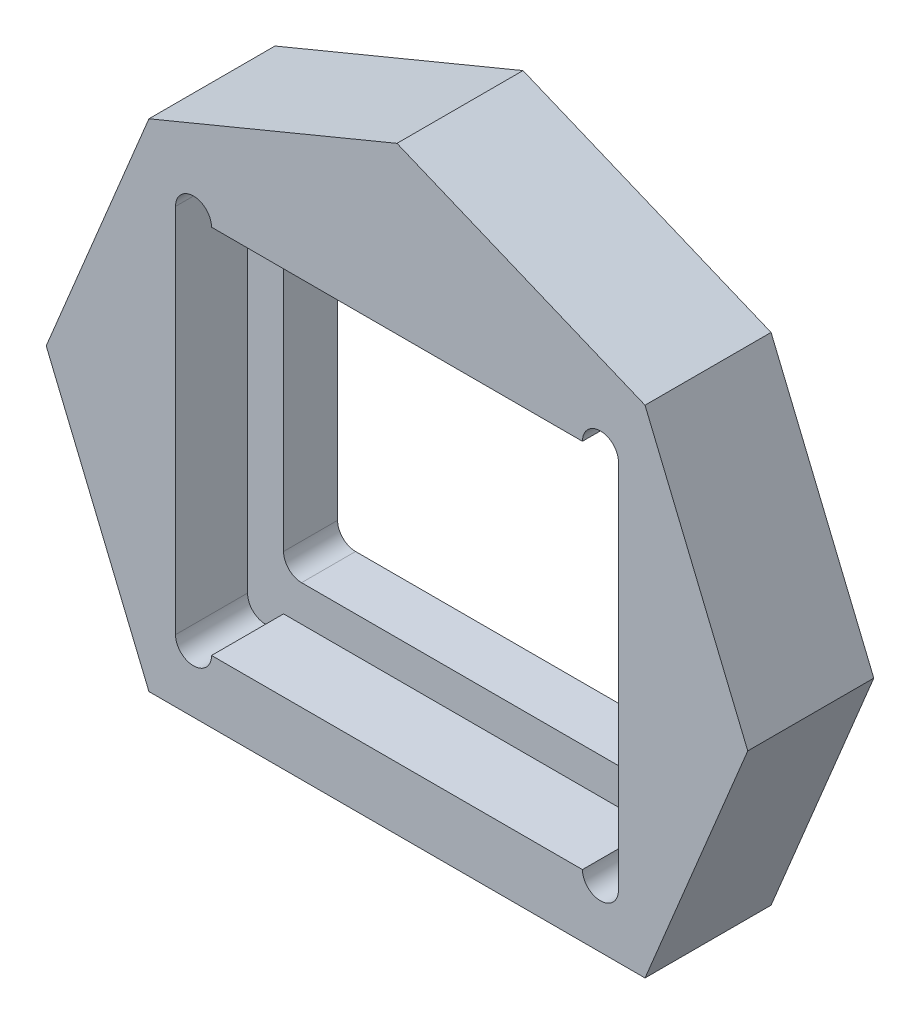
ISO-10303-21;
HEADER;
FILE_DESCRIPTION(('STEP AP214'),'2;1');
FILE_NAME('part.step','',(''),(''),'','','');
FILE_SCHEMA(('AUTOMOTIVE_DESIGN { 1 0 10303 214 1 1 1 1 }'));
ENDSEC;
DATA;
#1=APPLICATION_CONTEXT('core data for automotive mechanical design processes');
#2=APPLICATION_PROTOCOL_DEFINITION('international standard','automotive_design',2000,#1);
#3=PRODUCT_CONTEXT('',#1,'mechanical');
#4=PRODUCT('Part','Part','',(#3));
#5=PRODUCT_RELATED_PRODUCT_CATEGORY('part','',(#4));
#6=PRODUCT_DEFINITION_FORMATION('','',#4);
#7=PRODUCT_DEFINITION_CONTEXT('part definition',#1,'design');
#8=PRODUCT_DEFINITION('design','',#6,#7);
#9=PRODUCT_DEFINITION_SHAPE('','',#8);
#10=(LENGTH_UNIT() NAMED_UNIT(*) SI_UNIT(.MILLI.,.METRE.));
#11=(NAMED_UNIT(*) PLANE_ANGLE_UNIT() SI_UNIT($,.RADIAN.));
#12=(NAMED_UNIT(*) SI_UNIT($,.STERADIAN.) SOLID_ANGLE_UNIT());
#13=UNCERTAINTY_MEASURE_WITH_UNIT(LENGTH_MEASURE(1.E-05),#10,'distance_accuracy_value','');
#14=(GEOMETRIC_REPRESENTATION_CONTEXT(3) GLOBAL_UNCERTAINTY_ASSIGNED_CONTEXT((#13)) GLOBAL_UNIT_ASSIGNED_CONTEXT((#10,
#11,#12)) REPRESENTATION_CONTEXT('',''));
#15=CARTESIAN_POINT('',(0.,0.,0.));
#16=DIRECTION('',(0.,0.,1.));
#17=DIRECTION('',(1.,0.,0.));
#18=AXIS2_PLACEMENT_3D('',#15,#16,#17);
#19=CARTESIAN_POINT('',(0.,0.,1.5));
#20=DIRECTION('',(0.,0.,1.));
#21=DIRECTION('',(1.,0.,0.));
#22=AXIS2_PLACEMENT_3D('',#19,#20,#21);
#23=PLANE('',#22);
#24=CARTESIAN_POINT('',(-4.65,-3.65,1.5));
#25=DIRECTION('',(0.,0.,1.));
#26=DIRECTION('',(1.,0.,0.));
#27=AXIS2_PLACEMENT_3D('',#24,#25,#26);
#28=CIRCLE('',#27,0.5);
#29=CARTESIAN_POINT('',(-5.15,-3.65,1.5));
#30=VERTEX_POINT('',#29);
#31=CARTESIAN_POINT('',(-4.65,-4.15,1.5));
#32=VERTEX_POINT('',#31);
#33=EDGE_CURVE('E238',#30,#32,#28,.T.);
#34=ORIENTED_EDGE('',*,*,#33,.F.);
#35=DIRECTION('',(0.,-1.,0.));
#36=VECTOR('',#35,1.);
#37=CARTESIAN_POINT('',(-5.15,-3.65,1.5));
#38=LINE('',#37,#36);
#39=CARTESIAN_POINT('',(-5.15,3.65,1.5));
#40=VERTEX_POINT('',#39);
#41=EDGE_CURVE('E261',#40,#30,#38,.T.);
#42=ORIENTED_EDGE('',*,*,#41,.F.);
#43=CARTESIAN_POINT('',(-4.65,3.65,1.5));
#44=DIRECTION('',(0.,0.,1.));
#45=DIRECTION('',(-1.,0.,0.));
#46=AXIS2_PLACEMENT_3D('',#43,#44,#45);
#47=CIRCLE('',#46,0.5);
#48=CARTESIAN_POINT('',(-4.65,4.15,1.5));
#49=VERTEX_POINT('',#48);
#50=EDGE_CURVE('E257',#49,#40,#47,.T.);
#51=ORIENTED_EDGE('',*,*,#50,.F.);
#52=DIRECTION('',(-1.,0.,0.));
#53=VECTOR('',#52,1.);
#54=CARTESIAN_POINT('',(-4.65,4.15,1.5));
#55=LINE('',#54,#53);
#56=CARTESIAN_POINT('',(4.65,4.15,1.5));
#57=VERTEX_POINT('',#56);
#58=EDGE_CURVE('E254',#57,#49,#55,.T.);
#59=ORIENTED_EDGE('',*,*,#58,.F.);
#60=CARTESIAN_POINT('',(4.65,3.65,1.5));
#61=DIRECTION('',(0.,0.,1.));
#62=DIRECTION('',(-1.,0.,0.));
#63=AXIS2_PLACEMENT_3D('',#60,#61,#62);
#64=CIRCLE('',#63,0.500000000000001);
#65=CARTESIAN_POINT('',(5.15,3.65,1.5));
#66=VERTEX_POINT('',#65);
#67=EDGE_CURVE('E251',#66,#57,#64,.T.);
#68=ORIENTED_EDGE('',*,*,#67,.F.);
#69=DIRECTION('',(0.,1.,0.));
#70=VECTOR('',#69,1.);
#71=CARTESIAN_POINT('',(5.15,-3.65,1.5));
#72=LINE('',#71,#70);
#73=CARTESIAN_POINT('',(5.15,-3.65,1.5));
#74=VERTEX_POINT('',#73);
#75=EDGE_CURVE('E248',#74,#66,#72,.T.);
#76=ORIENTED_EDGE('',*,*,#75,.F.);
#77=CARTESIAN_POINT('',(4.65,-3.65,1.5));
#78=DIRECTION('',(0.,0.,1.));
#79=DIRECTION('',(-1.,0.,0.));
#80=AXIS2_PLACEMENT_3D('',#77,#78,#79);
#81=CIRCLE('',#80,0.5);
#82=CARTESIAN_POINT('',(4.65,-4.15,1.5));
#83=VERTEX_POINT('',#82);
#84=EDGE_CURVE('E245',#83,#74,#81,.T.);
#85=ORIENTED_EDGE('',*,*,#84,.F.);
#86=DIRECTION('',(1.,0.,0.));
#87=VECTOR('',#86,1.);
#88=CARTESIAN_POINT('',(-4.65,-4.15,1.5));
#89=LINE('',#88,#87);
#90=EDGE_CURVE('E241',#32,#83,#89,.T.);
#91=ORIENTED_EDGE('',*,*,#90,.F.);
#92=EDGE_LOOP('',(#34,#42,#51,#59,#68,#76,#85,#91));
#93=FACE_BOUND('',#92,.T.);
#94=DIRECTION('',(-1.,0.,0.));
#95=VECTOR('',#94,1.);
#96=CARTESIAN_POINT('',(-6.15,5.15,1.5));
#97=LINE('',#96,#95);
#98=CARTESIAN_POINT('',(5.15,5.15,1.5));
#99=VERTEX_POINT('',#98);
#100=CARTESIAN_POINT('',(-5.15,5.15,1.5));
#101=VERTEX_POINT('',#100);
#102=EDGE_CURVE('E399',#99,#101,#97,.T.);
#103=ORIENTED_EDGE('',*,*,#102,.T.);
#104=CARTESIAN_POINT('',(-5.65,5.15,1.5));
#105=DIRECTION('',(0.,0.,1.));
#106=DIRECTION('',(1.,0.,0.));
#107=AXIS2_PLACEMENT_3D('',#104,#105,#106);
#108=CIRCLE('',#107,0.5);
#109=CARTESIAN_POINT('',(-6.15,5.15,1.5));
#110=VERTEX_POINT('',#109);
#111=EDGE_CURVE('E445',#110,#101,#108,.F.);
#112=ORIENTED_EDGE('',*,*,#111,.F.);
#113=DIRECTION('',(0.,-1.,0.));
#114=VECTOR('',#113,1.);
#115=CARTESIAN_POINT('',(-6.15,-5.15,1.5));
#116=LINE('',#115,#114);
#117=CARTESIAN_POINT('',(-6.15,-5.15,1.5));
#118=VERTEX_POINT('',#117);
#119=EDGE_CURVE('E395',#110,#118,#116,.T.);
#120=ORIENTED_EDGE('',*,*,#119,.T.);
#121=CARTESIAN_POINT('',(-5.65,-5.15,1.5));
#122=DIRECTION('',(0.,0.,1.));
#123=DIRECTION('',(1.,0.,0.));
#124=AXIS2_PLACEMENT_3D('',#121,#122,#123);
#125=CIRCLE('',#124,0.5);
#126=CARTESIAN_POINT('',(-5.15,-5.15,1.5));
#127=VERTEX_POINT('',#126);
#128=EDGE_CURVE('E407',#127,#118,#125,.F.);
#129=ORIENTED_EDGE('',*,*,#128,.F.);
#130=DIRECTION('',(1.,0.,0.));
#131=VECTOR('',#130,1.);
#132=CARTESIAN_POINT('',(-6.15,-5.15,1.5));
#133=LINE('',#132,#131);
#134=CARTESIAN_POINT('',(5.15,-5.15,1.5));
#135=VERTEX_POINT('',#134);
#136=EDGE_CURVE('E390',#127,#135,#133,.T.);
#137=ORIENTED_EDGE('',*,*,#136,.T.);
#138=CARTESIAN_POINT('',(5.65,-5.15,1.5));
#139=DIRECTION('',(0.,0.,1.));
#140=DIRECTION('',(1.,0.,0.));
#141=AXIS2_PLACEMENT_3D('',#138,#139,#140);
#142=CIRCLE('',#141,0.499999999999999);
#143=CARTESIAN_POINT('',(6.15,-5.15,1.5));
#144=VERTEX_POINT('',#143);
#145=EDGE_CURVE('E433',#144,#135,#142,.F.);
#146=ORIENTED_EDGE('',*,*,#145,.F.);
#147=DIRECTION('',(0.,1.,0.));
#148=VECTOR('',#147,1.);
#149=CARTESIAN_POINT('',(6.15,-5.15,1.5));
#150=LINE('',#149,#148);
#151=CARTESIAN_POINT('',(6.15,5.15,1.5));
#152=VERTEX_POINT('',#151);
#153=EDGE_CURVE('E403',#144,#152,#150,.T.);
#154=ORIENTED_EDGE('',*,*,#153,.T.);
#155=CARTESIAN_POINT('',(5.65,5.15,1.5));
#156=DIRECTION('',(0.,0.,1.));
#157=DIRECTION('',(1.,0.,0.));
#158=AXIS2_PLACEMENT_3D('',#155,#156,#157);
#159=CIRCLE('',#158,0.5);
#160=EDGE_CURVE('E428',#99,#152,#159,.F.);
#161=ORIENTED_EDGE('',*,*,#160,.F.);
#162=EDGE_LOOP('',(#103,#112,#120,#129,#137,#146,#154,#161));
#163=FACE_BOUND('',#162,.T.);
#164=ADVANCED_FACE('F39',(#93,#163),#23,.T.);
#165=CARTESIAN_POINT('',(0.,0.,0.));
#166=DIRECTION('',(0.,0.,1.));
#167=DIRECTION('',(1.,0.,0.));
#168=AXIS2_PLACEMENT_3D('',#165,#166,#167);
#169=PLANE('',#168);
#170=DIRECTION('',(0.38268343236509,0.923879532511287,0.));
#171=VECTOR('',#170,1.);
#172=CARTESIAN_POINT('',(6.88830178257162,-6.88830178257162,0.));
#173=LINE('',#172,#171);
#174=CARTESIAN_POINT('',(6.88830178257162,-6.88830178257162,0.));
#175=VERTEX_POINT('',#174);
#176=CARTESIAN_POINT('',(9.74152980263155,0.,0.));
#177=VERTEX_POINT('',#176);
#178=EDGE_CURVE('E331',#175,#177,#173,.T.);
#179=ORIENTED_EDGE('',*,*,#178,.F.);
#180=DIRECTION('',(1.,0.,0.));
#181=VECTOR('',#180,1.);
#182=CARTESIAN_POINT('',(-6.88830178257162,-6.88830178257162,0.));
#183=LINE('',#182,#181);
#184=CARTESIAN_POINT('',(-6.88830178257162,-6.88830178257162,0.));
#185=VERTEX_POINT('',#184);
#186=EDGE_CURVE('E207',#185,#175,#183,.T.);
#187=ORIENTED_EDGE('',*,*,#186,.F.);
#188=DIRECTION('',(0.38268343236509,-0.923879532511287,0.));
#189=VECTOR('',#188,1.);
#190=CARTESIAN_POINT('',(-9.74152980263155,0.,0.));
#191=LINE('',#190,#189);
#192=CARTESIAN_POINT('',(-9.74152980263155,0.,0.));
#193=VERTEX_POINT('',#192);
#194=EDGE_CURVE('E216',#193,#185,#191,.T.);
#195=ORIENTED_EDGE('',*,*,#194,.F.);
#196=DIRECTION('',(-0.38268343236509,-0.923879532511287,0.));
#197=VECTOR('',#196,1.);
#198=CARTESIAN_POINT('',(-6.88830178257162,6.88830178257162,0.));
#199=LINE('',#198,#197);
#200=CARTESIAN_POINT('',(-6.88830178257162,6.88830178257162,0.));
#201=VERTEX_POINT('',#200);
#202=EDGE_CURVE('E326',#201,#193,#199,.T.);
#203=ORIENTED_EDGE('',*,*,#202,.F.);
#204=DIRECTION('',(-0.923879532511287,-0.382683432365089,0.));
#205=VECTOR('',#204,1.);
#206=CARTESIAN_POINT('',(0.,9.74152980263154,0.));
#207=LINE('',#206,#205);
#208=CARTESIAN_POINT('',(0.,9.74152980263154,0.));
#209=VERTEX_POINT('',#208);
#210=EDGE_CURVE('E323',#209,#201,#207,.T.);
#211=ORIENTED_EDGE('',*,*,#210,.F.);
#212=DIRECTION('',(-0.923879532511287,0.38268343236509,0.));
#213=VECTOR('',#212,1.);
#214=CARTESIAN_POINT('',(6.88830178257162,6.88830178257161,0.));
#215=LINE('',#214,#213);
#216=CARTESIAN_POINT('',(6.88830178257162,6.88830178257161,0.));
#217=VERTEX_POINT('',#216);
#218=EDGE_CURVE('E320',#217,#209,#215,.T.);
#219=ORIENTED_EDGE('',*,*,#218,.F.);
#220=DIRECTION('',(-0.38268343236509,0.923879532511287,0.));
#221=VECTOR('',#220,1.);
#222=CARTESIAN_POINT('',(9.74152980263155,0.,0.));
#223=LINE('',#222,#221);
#224=EDGE_CURVE('E316',#177,#217,#223,.T.);
#225=ORIENTED_EDGE('',*,*,#224,.F.);
#226=EDGE_LOOP('',(#179,#187,#195,#203,#211,#219,#225));
#227=FACE_BOUND('',#226,.T.);
#228=CARTESIAN_POINT('',(-4.65,-3.65,0.));
#229=DIRECTION('',(0.,0.,1.));
#230=DIRECTION('',(1.,0.,0.));
#231=AXIS2_PLACEMENT_3D('',#228,#229,#230);
#232=CIRCLE('',#231,0.5);
#233=CARTESIAN_POINT('',(-5.15,-3.65,0.));
#234=VERTEX_POINT('',#233);
#235=CARTESIAN_POINT('',(-4.65,-4.15,0.));
#236=VERTEX_POINT('',#235);
#237=EDGE_CURVE('E227',#234,#236,#232,.T.);
#238=ORIENTED_EDGE('',*,*,#237,.T.);
#239=DIRECTION('',(1.,0.,0.));
#240=VECTOR('',#239,1.);
#241=CARTESIAN_POINT('',(-4.65,-4.15,0.));
#242=LINE('',#241,#240);
#243=CARTESIAN_POINT('',(4.65,-4.15,0.));
#244=VERTEX_POINT('',#243);
#245=EDGE_CURVE('E232',#236,#244,#242,.T.);
#246=ORIENTED_EDGE('',*,*,#245,.T.);
#247=CARTESIAN_POINT('',(4.65,-3.65,0.));
#248=DIRECTION('',(0.,0.,1.));
#249=DIRECTION('',(-1.,0.,0.));
#250=AXIS2_PLACEMENT_3D('',#247,#248,#249);
#251=CIRCLE('',#250,0.5);
#252=CARTESIAN_POINT('',(5.15,-3.65,0.));
#253=VERTEX_POINT('',#252);
#254=EDGE_CURVE('E268',#244,#253,#251,.T.);
#255=ORIENTED_EDGE('',*,*,#254,.T.);
#256=DIRECTION('',(0.,1.,0.));
#257=VECTOR('',#256,1.);
#258=CARTESIAN_POINT('',(5.15,-3.65,0.));
#259=LINE('',#258,#257);
#260=CARTESIAN_POINT('',(5.15,3.65,0.));
#261=VERTEX_POINT('',#260);
#262=EDGE_CURVE('E272',#253,#261,#259,.T.);
#263=ORIENTED_EDGE('',*,*,#262,.T.);
#264=CARTESIAN_POINT('',(4.65,3.65,0.));
#265=DIRECTION('',(0.,0.,1.));
#266=DIRECTION('',(-1.,0.,0.));
#267=AXIS2_PLACEMENT_3D('',#264,#265,#266);
#268=CIRCLE('',#267,0.500000000000001);
#269=CARTESIAN_POINT('',(4.65,4.15,0.));
#270=VERTEX_POINT('',#269);
#271=EDGE_CURVE('E276',#261,#270,#268,.T.);
#272=ORIENTED_EDGE('',*,*,#271,.T.);
#273=DIRECTION('',(-1.,0.,0.));
#274=VECTOR('',#273,1.);
#275=CARTESIAN_POINT('',(-4.65,4.15,0.));
#276=LINE('',#275,#274);
#277=CARTESIAN_POINT('',(-4.65,4.15,0.));
#278=VERTEX_POINT('',#277);
#279=EDGE_CURVE('E280',#270,#278,#276,.T.);
#280=ORIENTED_EDGE('',*,*,#279,.T.);
#281=CARTESIAN_POINT('',(-4.65,3.65,0.));
#282=DIRECTION('',(0.,0.,1.));
#283=DIRECTION('',(-1.,0.,0.));
#284=AXIS2_PLACEMENT_3D('',#281,#282,#283);
#285=CIRCLE('',#284,0.5);
#286=CARTESIAN_POINT('',(-5.15,3.65,0.));
#287=VERTEX_POINT('',#286);
#288=EDGE_CURVE('E284',#278,#287,#285,.T.);
#289=ORIENTED_EDGE('',*,*,#288,.T.);
#290=DIRECTION('',(0.,-1.,0.));
#291=VECTOR('',#290,1.);
#292=CARTESIAN_POINT('',(-5.15,-3.65,0.));
#293=LINE('',#292,#291);
#294=EDGE_CURVE('E242',#287,#234,#293,.T.);
#295=ORIENTED_EDGE('',*,*,#294,.T.);
#296=EDGE_LOOP('',(#238,#246,#255,#263,#272,#280,#289,#295));
#297=FACE_BOUND('',#296,.T.);
#298=ADVANCED_FACE('F357',(#227,#297),#169,.F.);
#299=CARTESIAN_POINT('',(9.74152980263155,0.,1.5));
#300=DIRECTION('',(-0.923879532511287,-0.38268343236509,0.));
#301=DIRECTION('',(0.38268343236509,-0.923879532511287,0.));
#302=AXIS2_PLACEMENT_3D('',#299,#300,#301);
#303=PLANE('',#302);
#304=ORIENTED_EDGE('',*,*,#224,.T.);
#305=DIRECTION('',(0.,0.,-1.));
#306=VECTOR('',#305,1.);
#307=CARTESIAN_POINT('',(6.88830178257162,6.88830178257161,1.5));
#308=LINE('',#307,#306);
#309=CARTESIAN_POINT('',(6.88830178257162,6.88830178257161,3.5));
#310=VERTEX_POINT('',#309);
#311=EDGE_CURVE('E11',#310,#217,#308,.T.);
#312=ORIENTED_EDGE('',*,*,#311,.F.);
#313=DIRECTION('',(-0.38268343236509,0.923879532511287,0.));
#314=VECTOR('',#313,1.);
#315=CARTESIAN_POINT('',(9.74152980263155,0.,3.5));
#316=LINE('',#315,#314);
#317=CARTESIAN_POINT('',(9.74152980263155,0.,3.5));
#318=VERTEX_POINT('',#317);
#319=EDGE_CURVE('E366',#318,#310,#316,.T.);
#320=ORIENTED_EDGE('',*,*,#319,.F.);
#321=DIRECTION('',(0.,0.,-1.));
#322=VECTOR('',#321,1.);
#323=CARTESIAN_POINT('',(9.74152980263155,0.,1.5));
#324=LINE('',#323,#322);
#325=EDGE_CURVE('E334',#318,#177,#324,.T.);
#326=ORIENTED_EDGE('',*,*,#325,.T.);
#327=EDGE_LOOP('',(#304,#312,#320,#326));
#328=FACE_BOUND('',#327,.T.);
#329=ADVANCED_FACE('F41',(#328),#303,.F.);
#330=CARTESIAN_POINT('',(6.88830178257162,6.88830178257161,1.5));
#331=DIRECTION('',(-0.38268343236509,-0.923879532511287,0.));
#332=DIRECTION('',(0.923879532511287,-0.38268343236509,0.));
#333=AXIS2_PLACEMENT_3D('',#330,#331,#332);
#334=PLANE('',#333);
#335=ORIENTED_EDGE('',*,*,#218,.T.);
#336=DIRECTION('',(0.,0.,-1.));
#337=VECTOR('',#336,1.);
#338=CARTESIAN_POINT('',(0.,9.74152980263154,1.5));
#339=LINE('',#338,#337);
#340=CARTESIAN_POINT('',(0.,9.74152980263154,3.5));
#341=VERTEX_POINT('',#340);
#342=EDGE_CURVE('E48',#341,#209,#339,.T.);
#343=ORIENTED_EDGE('',*,*,#342,.F.);
#344=DIRECTION('',(-0.923879532511287,0.38268343236509,0.));
#345=VECTOR('',#344,1.);
#346=CARTESIAN_POINT('',(6.88830178257162,6.88830178257161,3.5));
#347=LINE('',#346,#345);
#348=EDGE_CURVE('E363',#310,#341,#347,.T.);
#349=ORIENTED_EDGE('',*,*,#348,.F.);
#350=ORIENTED_EDGE('',*,*,#311,.T.);
#351=EDGE_LOOP('',(#335,#343,#349,#350));
#352=FACE_BOUND('',#351,.T.);
#353=ADVANCED_FACE('F459',(#352),#334,.F.);
#354=CARTESIAN_POINT('',(0.,9.74152980263154,1.5));
#355=DIRECTION('',(0.382683432365089,-0.923879532511287,0.));
#356=DIRECTION('',(0.923879532511287,0.38268343236509,0.));
#357=AXIS2_PLACEMENT_3D('',#354,#355,#356);
#358=PLANE('',#357);
#359=ORIENTED_EDGE('',*,*,#210,.T.);
#360=DIRECTION('',(0.,0.,-1.));
#361=VECTOR('',#360,1.);
#362=CARTESIAN_POINT('',(-6.88830178257162,6.88830178257162,1.5));
#363=LINE('',#362,#361);
#364=CARTESIAN_POINT('',(-6.88830178257162,6.88830178257162,3.5));
#365=VERTEX_POINT('',#364);
#366=EDGE_CURVE('E342',#365,#201,#363,.T.);
#367=ORIENTED_EDGE('',*,*,#366,.F.);
#368=DIRECTION('',(-0.923879532511287,-0.382683432365089,0.));
#369=VECTOR('',#368,1.);
#370=CARTESIAN_POINT('',(0.,9.74152980263154,3.5));
#371=LINE('',#370,#369);
#372=EDGE_CURVE('E234',#341,#365,#371,.T.);
#373=ORIENTED_EDGE('',*,*,#372,.F.);
#374=ORIENTED_EDGE('',*,*,#342,.T.);
#375=EDGE_LOOP('',(#359,#367,#373,#374));
#376=FACE_BOUND('',#375,.T.);
#377=ADVANCED_FACE('F350',(#376),#358,.F.);
#378=CARTESIAN_POINT('',(-6.88830178257162,6.88830178257162,1.5));
#379=DIRECTION('',(0.923879532511287,-0.38268343236509,0.));
#380=DIRECTION('',(0.38268343236509,0.923879532511287,0.));
#381=AXIS2_PLACEMENT_3D('',#378,#379,#380);
#382=PLANE('',#381);
#383=ORIENTED_EDGE('',*,*,#202,.T.);
#384=DIRECTION('',(0.,0.,-1.));
#385=VECTOR('',#384,1.);
#386=CARTESIAN_POINT('',(-9.74152980263155,0.,1.5));
#387=LINE('',#386,#385);
#388=CARTESIAN_POINT('',(-9.74152980263155,0.,3.5));
#389=VERTEX_POINT('',#388);
#390=EDGE_CURVE('E218',#389,#193,#387,.T.);
#391=ORIENTED_EDGE('',*,*,#390,.F.);
#392=DIRECTION('',(-0.38268343236509,-0.923879532511287,0.));
#393=VECTOR('',#392,1.);
#394=CARTESIAN_POINT('',(-6.88830178257162,6.88830178257162,3.5));
#395=LINE('',#394,#393);
#396=EDGE_CURVE('E225',#365,#389,#395,.T.);
#397=ORIENTED_EDGE('',*,*,#396,.F.);
#398=ORIENTED_EDGE('',*,*,#366,.T.);
#399=EDGE_LOOP('',(#383,#391,#397,#398));
#400=FACE_BOUND('',#399,.T.);
#401=ADVANCED_FACE('F361',(#400),#382,.F.);
#402=CARTESIAN_POINT('',(-9.74152980263155,0.,1.5));
#403=DIRECTION('',(0.923879532511287,0.38268343236509,0.));
#404=DIRECTION('',(-0.38268343236509,0.923879532511287,0.));
#405=AXIS2_PLACEMENT_3D('',#402,#403,#404);
#406=PLANE('',#405);
#407=ORIENTED_EDGE('',*,*,#194,.T.);
#408=DIRECTION('',(0.,0.,-1.));
#409=VECTOR('',#408,1.);
#410=CARTESIAN_POINT('',(-6.88830178257162,-6.88830178257162,1.5));
#411=LINE('',#410,#409);
#412=CARTESIAN_POINT('',(-6.88830178257162,-6.88830178257162,3.5));
#413=VERTEX_POINT('',#412);
#414=EDGE_CURVE('E197',#413,#185,#411,.T.);
#415=ORIENTED_EDGE('',*,*,#414,.F.);
#416=DIRECTION('',(0.38268343236509,-0.923879532511287,0.));
#417=VECTOR('',#416,1.);
#418=CARTESIAN_POINT('',(-9.74152980263155,0.,3.5));
#419=LINE('',#418,#417);
#420=EDGE_CURVE('E214',#389,#413,#419,.T.);
#421=ORIENTED_EDGE('',*,*,#420,.F.);
#422=ORIENTED_EDGE('',*,*,#390,.T.);
#423=EDGE_LOOP('',(#407,#415,#421,#422));
#424=FACE_BOUND('',#423,.T.);
#425=ADVANCED_FACE('F212',(#424),#406,.F.);
#426=CARTESIAN_POINT('',(6.88830178257162,-6.88830178257162,1.5));
#427=DIRECTION('',(-0.923879532511287,0.38268343236509,0.));
#428=DIRECTION('',(-0.38268343236509,-0.923879532511287,0.));
#429=AXIS2_PLACEMENT_3D('',#426,#427,#428);
#430=PLANE('',#429);
#431=ORIENTED_EDGE('',*,*,#178,.T.);
#432=ORIENTED_EDGE('',*,*,#325,.F.);
#433=DIRECTION('',(0.38268343236509,0.923879532511287,0.));
#434=VECTOR('',#433,1.);
#435=CARTESIAN_POINT('',(6.88830178257162,-6.88830178257162,3.5));
#436=LINE('',#435,#434);
#437=CARTESIAN_POINT('',(6.88830178257162,-6.88830178257162,3.5));
#438=VERTEX_POINT('',#437);
#439=EDGE_CURVE('E371',#438,#318,#436,.T.);
#440=ORIENTED_EDGE('',*,*,#439,.F.);
#441=DIRECTION('',(0.,0.,-1.));
#442=VECTOR('',#441,1.);
#443=CARTESIAN_POINT('',(6.88830178257162,-6.88830178257162,1.5));
#444=LINE('',#443,#442);
#445=EDGE_CURVE('E200',#438,#175,#444,.T.);
#446=ORIENTED_EDGE('',*,*,#445,.T.);
#447=EDGE_LOOP('',(#431,#432,#440,#446));
#448=FACE_BOUND('',#447,.T.);
#449=ADVANCED_FACE('F456',(#448),#430,.F.);
#450=CARTESIAN_POINT('',(-4.65,-3.65,1.5));
#451=DIRECTION('',(0.,0.,-1.));
#452=DIRECTION('',(-1.,0.,0.));
#453=AXIS2_PLACEMENT_3D('',#450,#451,#452);
#454=CYLINDRICAL_SURFACE('',#453,0.5);
#455=ORIENTED_EDGE('',*,*,#237,.F.);
#456=DIRECTION('',(0.,0.,-1.));
#457=VECTOR('',#456,1.);
#458=CARTESIAN_POINT('',(-5.15,-3.65,1.5));
#459=LINE('',#458,#457);
#460=EDGE_CURVE('E263',#30,#234,#459,.T.);
#461=ORIENTED_EDGE('',*,*,#460,.F.);
#462=ORIENTED_EDGE('',*,*,#33,.T.);
#463=DIRECTION('',(0.,0.,-1.));
#464=VECTOR('',#463,1.);
#465=CARTESIAN_POINT('',(-4.65,-4.15,1.5));
#466=LINE('',#465,#464);
#467=EDGE_CURVE('E312',#32,#236,#466,.T.);
#468=ORIENTED_EDGE('',*,*,#467,.T.);
#469=EDGE_LOOP('',(#455,#461,#462,#468));
#470=FACE_BOUND('',#469,.T.);
#471=ADVANCED_FACE('F477',(#470),#454,.F.);
#472=CARTESIAN_POINT('',(-4.65,-4.15,1.5));
#473=DIRECTION('',(0.,1.,0.));
#474=DIRECTION('',(0.,0.,1.));
#475=AXIS2_PLACEMENT_3D('',#472,#473,#474);
#476=PLANE('',#475);
#477=ORIENTED_EDGE('',*,*,#245,.F.);
#478=ORIENTED_EDGE('',*,*,#467,.F.);
#479=ORIENTED_EDGE('',*,*,#90,.T.);
#480=DIRECTION('',(0.,0.,-1.));
#481=VECTOR('',#480,1.);
#482=CARTESIAN_POINT('',(4.65,-4.15,1.5));
#483=LINE('',#482,#481);
#484=EDGE_CURVE('E309',#83,#244,#483,.T.);
#485=ORIENTED_EDGE('',*,*,#484,.T.);
#486=EDGE_LOOP('',(#477,#478,#479,#485));
#487=FACE_BOUND('',#486,.T.);
#488=ADVANCED_FACE('F511',(#487),#476,.T.);
#489=CARTESIAN_POINT('',(4.65,-3.65,1.5));
#490=DIRECTION('',(0.,0.,-1.));
#491=DIRECTION('',(-1.,0.,0.));
#492=AXIS2_PLACEMENT_3D('',#489,#490,#491);
#493=CYLINDRICAL_SURFACE('',#492,0.5);
#494=ORIENTED_EDGE('',*,*,#254,.F.);
#495=ORIENTED_EDGE('',*,*,#484,.F.);
#496=ORIENTED_EDGE('',*,*,#84,.T.);
#497=DIRECTION('',(0.,0.,-1.));
#498=VECTOR('',#497,1.);
#499=CARTESIAN_POINT('',(5.15,-3.65,1.5));
#500=LINE('',#499,#498);
#501=EDGE_CURVE('E306',#74,#253,#500,.T.);
#502=ORIENTED_EDGE('',*,*,#501,.T.);
#503=EDGE_LOOP('',(#494,#495,#496,#502));
#504=FACE_BOUND('',#503,.T.);
#505=ADVANCED_FACE('F518',(#504),#493,.F.);
#506=CARTESIAN_POINT('',(5.15,-3.65,1.5));
#507=DIRECTION('',(-1.,0.,0.));
#508=DIRECTION('',(0.,-1.,0.));
#509=AXIS2_PLACEMENT_3D('',#506,#507,#508);
#510=PLANE('',#509);
#511=ORIENTED_EDGE('',*,*,#262,.F.);
#512=ORIENTED_EDGE('',*,*,#501,.F.);
#513=ORIENTED_EDGE('',*,*,#75,.T.);
#514=DIRECTION('',(0.,0.,-1.));
#515=VECTOR('',#514,1.);
#516=CARTESIAN_POINT('',(5.15,3.65,1.5));
#517=LINE('',#516,#515);
#518=EDGE_CURVE('E303',#66,#261,#517,.T.);
#519=ORIENTED_EDGE('',*,*,#518,.T.);
#520=EDGE_LOOP('',(#511,#512,#513,#519));
#521=FACE_BOUND('',#520,.T.);
#522=ADVANCED_FACE('F525',(#521),#510,.T.);
#523=CARTESIAN_POINT('',(4.65,3.65,1.5));
#524=DIRECTION('',(0.,0.,-1.));
#525=DIRECTION('',(-1.,0.,0.));
#526=AXIS2_PLACEMENT_3D('',#523,#524,#525);
#527=CYLINDRICAL_SURFACE('',#526,0.500000000000001);
#528=ORIENTED_EDGE('',*,*,#271,.F.);
#529=ORIENTED_EDGE('',*,*,#518,.F.);
#530=ORIENTED_EDGE('',*,*,#67,.T.);
#531=DIRECTION('',(0.,0.,-1.));
#532=VECTOR('',#531,1.);
#533=CARTESIAN_POINT('',(4.65,4.15,1.5));
#534=LINE('',#533,#532);
#535=EDGE_CURVE('E300',#57,#270,#534,.T.);
#536=ORIENTED_EDGE('',*,*,#535,.T.);
#537=EDGE_LOOP('',(#528,#529,#530,#536));
#538=FACE_BOUND('',#537,.T.);
#539=ADVANCED_FACE('F533',(#538),#527,.F.);
#540=CARTESIAN_POINT('',(-4.65,4.15,1.5));
#541=DIRECTION('',(0.,-1.,0.));
#542=DIRECTION('',(0.,0.,-1.));
#543=AXIS2_PLACEMENT_3D('',#540,#541,#542);
#544=PLANE('',#543);
#545=ORIENTED_EDGE('',*,*,#279,.F.);
#546=ORIENTED_EDGE('',*,*,#535,.F.);
#547=ORIENTED_EDGE('',*,*,#58,.T.);
#548=DIRECTION('',(0.,0.,-1.));
#549=VECTOR('',#548,1.);
#550=CARTESIAN_POINT('',(-4.65,4.15,1.5));
#551=LINE('',#550,#549);
#552=EDGE_CURVE('E297',#49,#278,#551,.T.);
#553=ORIENTED_EDGE('',*,*,#552,.T.);
#554=EDGE_LOOP('',(#545,#546,#547,#553));
#555=FACE_BOUND('',#554,.T.);
#556=ADVANCED_FACE('F541',(#555),#544,.T.);
#557=CARTESIAN_POINT('',(-4.65,3.65,1.5));
#558=DIRECTION('',(0.,0.,-1.));
#559=DIRECTION('',(-1.,0.,0.));
#560=AXIS2_PLACEMENT_3D('',#557,#558,#559);
#561=CYLINDRICAL_SURFACE('',#560,0.5);
#562=ORIENTED_EDGE('',*,*,#288,.F.);
#563=ORIENTED_EDGE('',*,*,#552,.F.);
#564=ORIENTED_EDGE('',*,*,#50,.T.);
#565=DIRECTION('',(0.,0.,-1.));
#566=VECTOR('',#565,1.);
#567=CARTESIAN_POINT('',(-5.15,3.65,1.5));
#568=LINE('',#567,#566);
#569=EDGE_CURVE('E294',#40,#287,#568,.T.);
#570=ORIENTED_EDGE('',*,*,#569,.T.);
#571=EDGE_LOOP('',(#562,#563,#564,#570));
#572=FACE_BOUND('',#571,.T.);
#573=ADVANCED_FACE('F549',(#572),#561,.F.);
#574=CARTESIAN_POINT('',(-5.15,-3.65,1.5));
#575=DIRECTION('',(1.,0.,0.));
#576=DIRECTION('',(0.,0.,-1.));
#577=AXIS2_PLACEMENT_3D('',#574,#575,#576);
#578=PLANE('',#577);
#579=ORIENTED_EDGE('',*,*,#294,.F.);
#580=ORIENTED_EDGE('',*,*,#569,.F.);
#581=ORIENTED_EDGE('',*,*,#41,.T.);
#582=ORIENTED_EDGE('',*,*,#460,.T.);
#583=EDGE_LOOP('',(#579,#580,#581,#582));
#584=FACE_BOUND('',#583,.T.);
#585=ADVANCED_FACE('F557',(#584),#578,.T.);
#586=CARTESIAN_POINT('',(0.,0.,3.5));
#587=DIRECTION('',(0.,0.,1.));
#588=DIRECTION('',(1.,0.,0.));
#589=AXIS2_PLACEMENT_3D('',#586,#587,#588);
#590=PLANE('',#589);
#591=DIRECTION('',(-1.,0.,0.));
#592=VECTOR('',#591,1.);
#593=CARTESIAN_POINT('',(-6.88830178257162,-6.88830178257162,3.5));
#594=LINE('',#593,#592);
#595=EDGE_CURVE('E194',#438,#413,#594,.T.);
#596=ORIENTED_EDGE('',*,*,#595,.F.);
#597=ORIENTED_EDGE('',*,*,#439,.T.);
#598=ORIENTED_EDGE('',*,*,#319,.T.);
#599=ORIENTED_EDGE('',*,*,#348,.T.);
#600=ORIENTED_EDGE('',*,*,#372,.T.);
#601=ORIENTED_EDGE('',*,*,#396,.T.);
#602=ORIENTED_EDGE('',*,*,#420,.T.);
#603=EDGE_LOOP('',(#596,#597,#598,#599,#600,#601,#602));
#604=FACE_BOUND('',#603,.T.);
#605=CARTESIAN_POINT('',(-5.65,-5.15,3.5));
#606=DIRECTION('',(0.,0.,1.));
#607=DIRECTION('',(1.,0.,0.));
#608=AXIS2_PLACEMENT_3D('',#605,#606,#607);
#609=CIRCLE('',#608,0.5);
#610=CARTESIAN_POINT('',(-6.15,-5.15,3.5));
#611=VERTEX_POINT('',#610);
#612=CARTESIAN_POINT('',(-5.15,-5.15,3.5));
#613=VERTEX_POINT('',#612);
#614=EDGE_CURVE('E436',#611,#613,#609,.T.);
#615=ORIENTED_EDGE('',*,*,#614,.F.);
#616=DIRECTION('',(0.,-1.,0.));
#617=VECTOR('',#616,1.);
#618=CARTESIAN_POINT('',(-6.15,-5.15,3.5));
#619=LINE('',#618,#617);
#620=CARTESIAN_POINT('',(-6.15,5.15,3.5));
#621=VERTEX_POINT('',#620);
#622=EDGE_CURVE('E411',#621,#611,#619,.T.);
#623=ORIENTED_EDGE('',*,*,#622,.F.);
#624=CARTESIAN_POINT('',(-5.65,5.15,3.5));
#625=DIRECTION('',(0.,0.,1.));
#626=DIRECTION('',(1.,0.,0.));
#627=AXIS2_PLACEMENT_3D('',#624,#625,#626);
#628=CIRCLE('',#627,0.5);
#629=CARTESIAN_POINT('',(-5.15,5.15,3.5));
#630=VERTEX_POINT('',#629);
#631=EDGE_CURVE('E442',#630,#621,#628,.T.);
#632=ORIENTED_EDGE('',*,*,#631,.F.);
#633=DIRECTION('',(-1.,0.,0.));
#634=VECTOR('',#633,1.);
#635=CARTESIAN_POINT('',(-6.15,5.15,3.5));
#636=LINE('',#635,#634);
#637=CARTESIAN_POINT('',(5.15,5.15,3.5));
#638=VERTEX_POINT('',#637);
#639=EDGE_CURVE('E415',#638,#630,#636,.T.);
#640=ORIENTED_EDGE('',*,*,#639,.F.);
#641=CARTESIAN_POINT('',(5.65,5.15,3.5));
#642=DIRECTION('',(0.,0.,1.));
#643=DIRECTION('',(1.,0.,0.));
#644=AXIS2_PLACEMENT_3D('',#641,#642,#643);
#645=CIRCLE('',#644,0.5);
#646=CARTESIAN_POINT('',(6.15,5.15,3.5));
#647=VERTEX_POINT('',#646);
#648=EDGE_CURVE('E425',#647,#638,#645,.T.);
#649=ORIENTED_EDGE('',*,*,#648,.F.);
#650=DIRECTION('',(0.,1.,0.));
#651=VECTOR('',#650,1.);
#652=CARTESIAN_POINT('',(6.15,-5.15,3.5));
#653=LINE('',#652,#651);
#654=CARTESIAN_POINT('',(6.15,-5.15,3.5));
#655=VERTEX_POINT('',#654);
#656=EDGE_CURVE('E394',#655,#647,#653,.T.);
#657=ORIENTED_EDGE('',*,*,#656,.F.);
#658=CARTESIAN_POINT('',(5.65,-5.15,3.5));
#659=DIRECTION('',(0.,0.,1.));
#660=DIRECTION('',(1.,0.,0.));
#661=AXIS2_PLACEMENT_3D('',#658,#659,#660);
#662=CIRCLE('',#661,0.499999999999999);
#663=CARTESIAN_POINT('',(5.15,-5.15,3.5));
#664=VERTEX_POINT('',#663);
#665=EDGE_CURVE('E206',#664,#655,#662,.T.);
#666=ORIENTED_EDGE('',*,*,#665,.F.);
#667=DIRECTION('',(1.,0.,0.));
#668=VECTOR('',#667,1.);
#669=CARTESIAN_POINT('',(-6.15,-5.15,3.5));
#670=LINE('',#669,#668);
#671=EDGE_CURVE('E389',#613,#664,#670,.T.);
#672=ORIENTED_EDGE('',*,*,#671,.F.);
#673=EDGE_LOOP('',(#615,#623,#632,#640,#649,#657,#666,#672));
#674=FACE_BOUND('',#673,.T.);
#675=ADVANCED_FACE('F221',(#604,#674),#590,.T.);
#676=CARTESIAN_POINT('',(6.15,-5.15,3.5));
#677=DIRECTION('',(-1.,0.,0.));
#678=DIRECTION('',(0.,0.,1.));
#679=AXIS2_PLACEMENT_3D('',#676,#677,#678);
#680=PLANE('',#679);
#681=ORIENTED_EDGE('',*,*,#153,.F.);
#682=DIRECTION('',(0.,0.,-1.));
#683=VECTOR('',#682,1.);
#684=CARTESIAN_POINT('',(6.15,-5.15,3.5));
#685=LINE('',#684,#683);
#686=EDGE_CURVE('E386',#655,#144,#685,.T.);
#687=ORIENTED_EDGE('',*,*,#686,.F.);
#688=ORIENTED_EDGE('',*,*,#656,.T.);
#689=DIRECTION('',(0.,0.,-1.));
#690=VECTOR('',#689,1.);
#691=CARTESIAN_POINT('',(6.15,5.15,3.5));
#692=LINE('',#691,#690);
#693=EDGE_CURVE('E374',#647,#152,#692,.T.);
#694=ORIENTED_EDGE('',*,*,#693,.T.);
#695=EDGE_LOOP('',(#681,#687,#688,#694));
#696=FACE_BOUND('',#695,.T.);
#697=ADVANCED_FACE('F572',(#696),#680,.T.);
#698=CARTESIAN_POINT('',(-6.15,5.15,3.5));
#699=DIRECTION('',(0.,-1.,0.));
#700=DIRECTION('',(0.,0.,-1.));
#701=AXIS2_PLACEMENT_3D('',#698,#699,#700);
#702=PLANE('',#701);
#703=DIRECTION('',(0.,0.,1.));
#704=VECTOR('',#703,1.);
#705=CARTESIAN_POINT('',(-5.15,5.15,-9.84416149391395));
#706=LINE('',#705,#704);
#707=EDGE_CURVE('E441',#101,#630,#706,.T.);
#708=ORIENTED_EDGE('',*,*,#707,.F.);
#709=ORIENTED_EDGE('',*,*,#102,.F.);
#710=DIRECTION('',(0.,0.,1.));
#711=VECTOR('',#710,1.);
#712=CARTESIAN_POINT('',(5.15,5.15,-9.84416149391395));
#713=LINE('',#712,#711);
#714=EDGE_CURVE('E55',#99,#638,#713,.T.);
#715=ORIENTED_EDGE('',*,*,#714,.T.);
#716=ORIENTED_EDGE('',*,*,#639,.T.);
#717=EDGE_LOOP('',(#708,#709,#715,#716));
#718=FACE_BOUND('',#717,.T.);
#719=ADVANCED_FACE('F582',(#718),#702,.T.);
#720=CARTESIAN_POINT('',(-6.15,-5.15,3.5));
#721=DIRECTION('',(1.,0.,0.));
#722=DIRECTION('',(0.,0.,-1.));
#723=AXIS2_PLACEMENT_3D('',#720,#721,#722);
#724=PLANE('',#723);
#725=ORIENTED_EDGE('',*,*,#119,.F.);
#726=DIRECTION('',(0.,0.,-1.));
#727=VECTOR('',#726,1.);
#728=CARTESIAN_POINT('',(-6.15,5.15,3.5));
#729=LINE('',#728,#727);
#730=EDGE_CURVE('E378',#621,#110,#729,.T.);
#731=ORIENTED_EDGE('',*,*,#730,.F.);
#732=ORIENTED_EDGE('',*,*,#622,.T.);
#733=DIRECTION('',(0.,0.,-1.));
#734=VECTOR('',#733,1.);
#735=CARTESIAN_POINT('',(-6.15,-5.15,3.5));
#736=LINE('',#735,#734);
#737=EDGE_CURVE('E382',#611,#118,#736,.T.);
#738=ORIENTED_EDGE('',*,*,#737,.T.);
#739=EDGE_LOOP('',(#725,#731,#732,#738));
#740=FACE_BOUND('',#739,.T.);
#741=ADVANCED_FACE('F589',(#740),#724,.T.);
#742=CARTESIAN_POINT('',(-6.15,-5.15,3.5));
#743=DIRECTION('',(0.,1.,0.));
#744=DIRECTION('',(0.,0.,1.));
#745=AXIS2_PLACEMENT_3D('',#742,#743,#744);
#746=PLANE('',#745);
#747=DIRECTION('',(0.,0.,1.));
#748=VECTOR('',#747,1.);
#749=CARTESIAN_POINT('',(-5.15,-5.15,-9.84416149391395));
#750=LINE('',#749,#748);
#751=EDGE_CURVE('E63',#127,#613,#750,.T.);
#752=ORIENTED_EDGE('',*,*,#751,.T.);
#753=ORIENTED_EDGE('',*,*,#671,.T.);
#754=DIRECTION('',(0.,0.,1.));
#755=VECTOR('',#754,1.);
#756=CARTESIAN_POINT('',(5.15,-5.15,-9.84416149391395));
#757=LINE('',#756,#755);
#758=EDGE_CURVE('E424',#135,#664,#757,.T.);
#759=ORIENTED_EDGE('',*,*,#758,.F.);
#760=ORIENTED_EDGE('',*,*,#136,.F.);
#761=EDGE_LOOP('',(#752,#753,#759,#760));
#762=FACE_BOUND('',#761,.T.);
#763=ADVANCED_FACE('F597',(#762),#746,.T.);
#764=CARTESIAN_POINT('',(5.65,-5.15,-9.84416149391395));
#765=DIRECTION('',(0.,0.,1.));
#766=DIRECTION('',(1.,0.,0.));
#767=AXIS2_PLACEMENT_3D('',#764,#765,#766);
#768=CYLINDRICAL_SURFACE('',#767,0.499999999999999);
#769=ORIENTED_EDGE('',*,*,#145,.T.);
#770=ORIENTED_EDGE('',*,*,#758,.T.);
#771=ORIENTED_EDGE('',*,*,#665,.T.);
#772=ORIENTED_EDGE('',*,*,#686,.T.);
#773=EDGE_LOOP('',(#769,#770,#771,#772));
#774=FACE_BOUND('',#773,.T.);
#775=ADVANCED_FACE('F605',(#774),#768,.F.);
#776=CARTESIAN_POINT('',(-5.65,-5.15,-9.84416149391395));
#777=DIRECTION('',(0.,0.,1.));
#778=DIRECTION('',(1.,0.,0.));
#779=AXIS2_PLACEMENT_3D('',#776,#777,#778);
#780=CYLINDRICAL_SURFACE('',#779,0.5);
#781=ORIENTED_EDGE('',*,*,#128,.T.);
#782=ORIENTED_EDGE('',*,*,#737,.F.);
#783=ORIENTED_EDGE('',*,*,#614,.T.);
#784=ORIENTED_EDGE('',*,*,#751,.F.);
#785=EDGE_LOOP('',(#781,#782,#783,#784));
#786=FACE_BOUND('',#785,.T.);
#787=ADVANCED_FACE('F613',(#786),#780,.F.);
#788=CARTESIAN_POINT('',(-5.65,5.15,-9.84416149391395));
#789=DIRECTION('',(0.,0.,1.));
#790=DIRECTION('',(1.,0.,0.));
#791=AXIS2_PLACEMENT_3D('',#788,#789,#790);
#792=CYLINDRICAL_SURFACE('',#791,0.5);
#793=ORIENTED_EDGE('',*,*,#111,.T.);
#794=ORIENTED_EDGE('',*,*,#707,.T.);
#795=ORIENTED_EDGE('',*,*,#631,.T.);
#796=ORIENTED_EDGE('',*,*,#730,.T.);
#797=EDGE_LOOP('',(#793,#794,#795,#796));
#798=FACE_BOUND('',#797,.T.);
#799=ADVANCED_FACE('F621',(#798),#792,.F.);
#800=CARTESIAN_POINT('',(5.65,5.15,-9.84416149391395));
#801=DIRECTION('',(0.,0.,1.));
#802=DIRECTION('',(1.,0.,0.));
#803=AXIS2_PLACEMENT_3D('',#800,#801,#802);
#804=CYLINDRICAL_SURFACE('',#803,0.5);
#805=ORIENTED_EDGE('',*,*,#160,.T.);
#806=ORIENTED_EDGE('',*,*,#693,.F.);
#807=ORIENTED_EDGE('',*,*,#648,.T.);
#808=ORIENTED_EDGE('',*,*,#714,.F.);
#809=EDGE_LOOP('',(#805,#806,#807,#808));
#810=FACE_BOUND('',#809,.T.);
#811=ADVANCED_FACE('F628',(#810),#804,.F.);
#812=CARTESIAN_POINT('',(-6.88830178257162,-6.88830178257162,-0.00100000000000013));
#813=DIRECTION('',(0.,1.,0.));
#814=DIRECTION('',(-1.,0.,0.));
#815=AXIS2_PLACEMENT_3D('',#812,#813,#814);
#816=PLANE('',#815);
#817=ORIENTED_EDGE('',*,*,#186,.T.);
#818=ORIENTED_EDGE('',*,*,#445,.F.);
#819=ORIENTED_EDGE('',*,*,#595,.T.);
#820=ORIENTED_EDGE('',*,*,#414,.T.);
#821=EDGE_LOOP('',(#817,#818,#819,#820));
#822=FACE_BOUND('',#821,.T.);
#823=ADVANCED_FACE('F196',(#822),#816,.F.);
#824=CLOSED_SHELL('',(#164,#298,#329,#353,#377,#401,#425,#449,#471,#488,#505,#522,#539,#556,
#573,#585,#675,#697,#719,#741,#763,#775,#787,#799,#811,#823));
#825=MANIFOLD_SOLID_BREP('B2',#824);
#826=ADVANCED_BREP_SHAPE_REPRESENTATION('',(#18,#825),#14);
#827=SHAPE_DEFINITION_REPRESENTATION(#9,#826);
ENDSEC;
END-ISO-10303-21;
